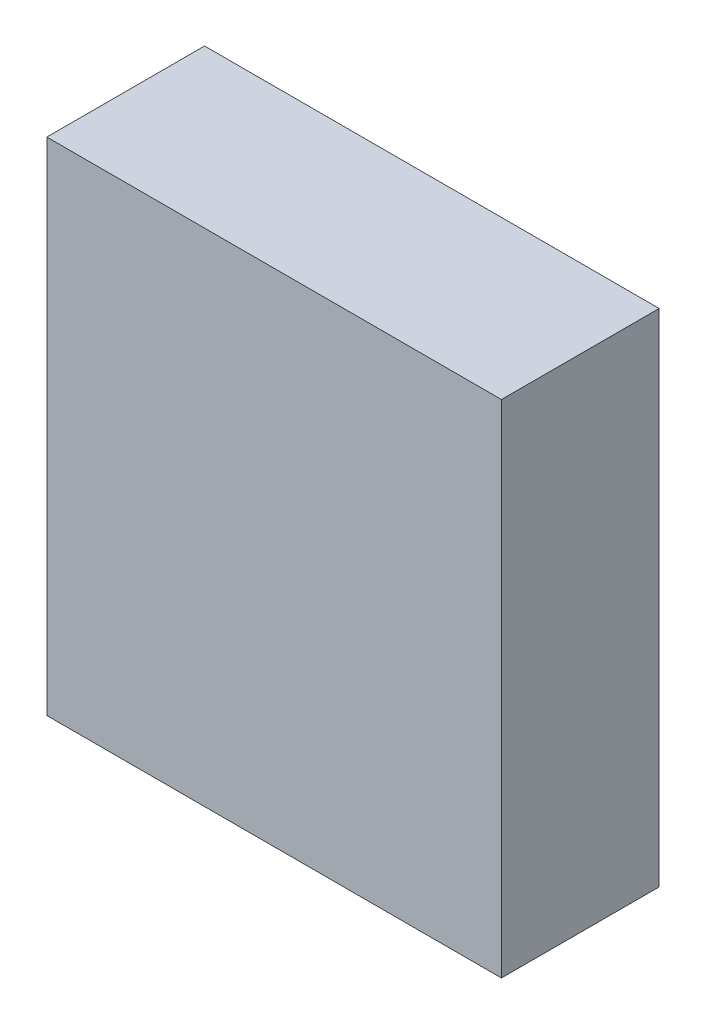
ISO-10303-21;
HEADER;
FILE_DESCRIPTION(('STEP AP214'),'2;1');
FILE_NAME('part.step','',(''),(''),'','','');
FILE_SCHEMA(('AUTOMOTIVE_DESIGN { 1 0 10303 214 1 1 1 1 }'));
ENDSEC;
DATA;
#1=APPLICATION_CONTEXT('core data for automotive mechanical design processes');
#2=APPLICATION_PROTOCOL_DEFINITION('international standard','automotive_design',2000,#1);
#3=PRODUCT_CONTEXT('',#1,'mechanical');
#4=PRODUCT('Part','Part','',(#3));
#5=PRODUCT_RELATED_PRODUCT_CATEGORY('part','',(#4));
#6=PRODUCT_DEFINITION_FORMATION('','',#4);
#7=PRODUCT_DEFINITION_CONTEXT('part definition',#1,'design');
#8=PRODUCT_DEFINITION('design','',#6,#7);
#9=PRODUCT_DEFINITION_SHAPE('','',#8);
#10=(LENGTH_UNIT() NAMED_UNIT(*) SI_UNIT(.MILLI.,.METRE.));
#11=(NAMED_UNIT(*) PLANE_ANGLE_UNIT() SI_UNIT($,.RADIAN.));
#12=(NAMED_UNIT(*) SI_UNIT($,.STERADIAN.) SOLID_ANGLE_UNIT());
#13=UNCERTAINTY_MEASURE_WITH_UNIT(LENGTH_MEASURE(1.E-05),#10,'distance_accuracy_value','');
#14=(GEOMETRIC_REPRESENTATION_CONTEXT(3) GLOBAL_UNCERTAINTY_ASSIGNED_CONTEXT((#13)) GLOBAL_UNIT_ASSIGNED_CONTEXT((#10,
#11,#12)) REPRESENTATION_CONTEXT('',''));
#15=CARTESIAN_POINT('',(0.,0.,0.));
#16=DIRECTION('',(0.,0.,1.));
#17=DIRECTION('',(1.,0.,0.));
#18=AXIS2_PLACEMENT_3D('',#15,#16,#17);
#19=CARTESIAN_POINT('',(-2.45000061648963,2.69998250302808,0.));
#20=DIRECTION('',(-1.,1.19248806385031E-08,0.));
#21=DIRECTION('',(-1.19248806385031E-08,-1.,0.));
#22=AXIS2_PLACEMENT_3D('',#19,#20,#21);
#23=PLANE('',#22);
#24=DIRECTION('',(-1.19248806627069E-08,-1.,0.));
#25=VECTOR('',#24,1.);
#26=CARTESIAN_POINT('',(-2.45000061648963,2.69998250302808,0.));
#27=LINE('',#26,#25);
#28=CARTESIAN_POINT('',(-2.45000061648963,2.69998250302808,0.));
#29=VERTEX_POINT('',#28);
#30=CARTESIAN_POINT('',(-2.45000068088392,-2.70001139345629,0.));
#31=VERTEX_POINT('',#30);
#32=EDGE_CURVE('E11',#29,#31,#27,.T.);
#33=ORIENTED_EDGE('',*,*,#32,.T.);
#34=DIRECTION('',(0.,0.,1.));
#35=VECTOR('',#34,1.);
#36=CARTESIAN_POINT('',(-2.45000068088391,-2.70001139345629,0.));
#37=LINE('',#36,#35);
#38=CARTESIAN_POINT('',(-2.45000068088392,-2.70001139345629,1.6999990940094));
#39=VERTEX_POINT('',#38);
#40=EDGE_CURVE('E88',#31,#39,#37,.T.);
#41=ORIENTED_EDGE('',*,*,#40,.T.);
#42=DIRECTION('',(-1.19248806627069E-08,-1.,0.));
#43=VECTOR('',#42,1.);
#44=CARTESIAN_POINT('',(-2.45000061648963,2.69998250302808,1.6999990940094));
#45=LINE('',#44,#43);
#46=CARTESIAN_POINT('',(-2.45000061648963,2.69998250302808,1.6999990940094));
#47=VERTEX_POINT('',#46);
#48=EDGE_CURVE('E83',#47,#39,#45,.T.);
#49=ORIENTED_EDGE('',*,*,#48,.F.);
#50=DIRECTION('',(0.,0.,1.));
#51=VECTOR('',#50,1.);
#52=CARTESIAN_POINT('',(-2.45000061648964,2.69998250302806,0.));
#53=LINE('',#52,#51);
#54=EDGE_CURVE('E72',#29,#47,#53,.T.);
#55=ORIENTED_EDGE('',*,*,#54,.F.);
#56=EDGE_LOOP('',(#33,#41,#49,#55));
#57=FACE_BOUND('',#56,.T.);
#58=ADVANCED_FACE('F17',(#57),#23,.T.);
#59=CARTESIAN_POINT('',(-2.45000068088392,-2.70001139345629,0.));
#60=DIRECTION('',(-1.19248806385031E-08,-1.,0.));
#61=DIRECTION('',(1.,-1.19248806385031E-08,0.));
#62=AXIS2_PLACEMENT_3D('',#59,#60,#61);
#63=PLANE('',#62);
#64=DIRECTION('',(1.,-1.1924880625848E-08,0.));
#65=VECTOR('',#64,1.);
#66=CARTESIAN_POINT('',(-2.45000068088392,-2.70001139345629,0.));
#67=LINE('',#66,#65);
#68=CARTESIAN_POINT('',(2.44999703029772,-2.7000114518882,0.));
#69=VERTEX_POINT('',#68);
#70=EDGE_CURVE('E24',#31,#69,#67,.T.);
#71=ORIENTED_EDGE('',*,*,#70,.T.);
#72=DIRECTION('',(0.,0.,1.));
#73=VECTOR('',#72,1.);
#74=CARTESIAN_POINT('',(2.44999703029772,-2.70001145188818,0.));
#75=LINE('',#74,#73);
#76=CARTESIAN_POINT('',(2.44999703029772,-2.7000114518882,1.6999990940094));
#77=VERTEX_POINT('',#76);
#78=EDGE_CURVE('E85',#69,#77,#75,.T.);
#79=ORIENTED_EDGE('',*,*,#78,.T.);
#80=DIRECTION('',(1.,-1.1924880625848E-08,0.));
#81=VECTOR('',#80,1.);
#82=CARTESIAN_POINT('',(-2.45000068088392,-2.70001139345629,1.6999990940094));
#83=LINE('',#82,#81);
#84=EDGE_CURVE('E66',#39,#77,#83,.T.);
#85=ORIENTED_EDGE('',*,*,#84,.F.);
#86=ORIENTED_EDGE('',*,*,#40,.F.);
#87=EDGE_LOOP('',(#71,#79,#85,#86));
#88=FACE_BOUND('',#87,.T.);
#89=ADVANCED_FACE('F89',(#88),#63,.T.);
#90=CARTESIAN_POINT('',(2.44999703029772,-2.7000114518882,0.));
#91=DIRECTION('',(1.,-1.19248806385031E-08,0.));
#92=DIRECTION('',(1.19248806385031E-08,1.,0.));
#93=AXIS2_PLACEMENT_3D('',#90,#91,#92);
#94=PLANE('',#93);
#95=DIRECTION('',(1.19248806627069E-08,1.,0.));
#96=VECTOR('',#95,1.);
#97=CARTESIAN_POINT('',(2.44999703029772,-2.7000114518882,0.));
#98=LINE('',#97,#96);
#99=CARTESIAN_POINT('',(2.449997094692,2.69998244459617,0.));
#100=VERTEX_POINT('',#99);
#101=EDGE_CURVE('E62',#69,#100,#98,.T.);
#102=ORIENTED_EDGE('',*,*,#101,.T.);
#103=DIRECTION('',(0.,0.,1.));
#104=VECTOR('',#103,1.);
#105=CARTESIAN_POINT('',(2.44999709469201,2.69998244459617,0.));
#106=LINE('',#105,#104);
#107=CARTESIAN_POINT('',(2.449997094692,2.69998244459617,1.6999990940094));
#108=VERTEX_POINT('',#107);
#109=EDGE_CURVE('E55',#100,#108,#106,.T.);
#110=ORIENTED_EDGE('',*,*,#109,.T.);
#111=DIRECTION('',(1.19248806627069E-08,1.,0.));
#112=VECTOR('',#111,1.);
#113=CARTESIAN_POINT('',(2.44999703029772,-2.7000114518882,1.6999990940094));
#114=LINE('',#113,#112);
#115=EDGE_CURVE('E59',#77,#108,#114,.T.);
#116=ORIENTED_EDGE('',*,*,#115,.F.);
#117=ORIENTED_EDGE('',*,*,#78,.F.);
#118=EDGE_LOOP('',(#102,#110,#116,#117));
#119=FACE_BOUND('',#118,.T.);
#120=ADVANCED_FACE('F57',(#119),#94,.T.);
#121=CARTESIAN_POINT('',(2.449997094692,2.69998244459617,0.));
#122=DIRECTION('',(1.19248806385031E-08,1.,0.));
#123=DIRECTION('',(-1.,1.19248806385031E-08,0.));
#124=AXIS2_PLACEMENT_3D('',#121,#122,#123);
#125=PLANE('',#124);
#126=DIRECTION('',(-1.,1.1924880625848E-08,0.));
#127=VECTOR('',#126,1.);
#128=CARTESIAN_POINT('',(2.449997094692,2.69998244459617,0.));
#129=LINE('',#128,#127);
#130=EDGE_CURVE('E65',#100,#29,#129,.T.);
#131=ORIENTED_EDGE('',*,*,#130,.T.);
#132=ORIENTED_EDGE('',*,*,#54,.T.);
#133=DIRECTION('',(-1.,1.1924880625848E-08,0.));
#134=VECTOR('',#133,1.);
#135=CARTESIAN_POINT('',(2.449997094692,2.69998244459617,1.6999990940094));
#136=LINE('',#135,#134);
#137=EDGE_CURVE('E70',#108,#47,#136,.T.);
#138=ORIENTED_EDGE('',*,*,#137,.F.);
#139=ORIENTED_EDGE('',*,*,#109,.F.);
#140=EDGE_LOOP('',(#131,#132,#138,#139));
#141=FACE_BOUND('',#140,.T.);
#142=ADVANCED_FACE('F71',(#141),#125,.T.);
#143=CARTESIAN_POINT('',(65.7749938964844,-329.475006103516,1.6999990940094));
#144=DIRECTION('',(0.,0.,1.));
#145=DIRECTION('',(1.19248806385031E-08,1.,0.));
#146=AXIS2_PLACEMENT_3D('',#143,#144,#145);
#147=PLANE('',#146);
#148=ORIENTED_EDGE('',*,*,#48,.T.);
#149=ORIENTED_EDGE('',*,*,#84,.T.);
#150=ORIENTED_EDGE('',*,*,#115,.T.);
#151=ORIENTED_EDGE('',*,*,#137,.T.);
#152=EDGE_LOOP('',(#148,#149,#150,#151));
#153=FACE_BOUND('',#152,.T.);
#154=ADVANCED_FACE('F76',(#153),#147,.T.);
#155=CARTESIAN_POINT('',(65.7749938964844,-329.475006103516,0.));
#156=DIRECTION('',(0.,0.,1.));
#157=DIRECTION('',(1.19248806385031E-08,1.,0.));
#158=AXIS2_PLACEMENT_3D('',#155,#156,#157);
#159=PLANE('',#158);
#160=ORIENTED_EDGE('',*,*,#130,.F.);
#161=ORIENTED_EDGE('',*,*,#101,.F.);
#162=ORIENTED_EDGE('',*,*,#70,.F.);
#163=ORIENTED_EDGE('',*,*,#32,.F.);
#164=EDGE_LOOP('',(#160,#161,#162,#163));
#165=FACE_BOUND('',#164,.T.);
#166=ADVANCED_FACE('F91',(#165),#159,.F.);
#167=CLOSED_SHELL('',(#58,#89,#120,#142,#154,#166));
#168=MANIFOLD_SOLID_BREP('B1',#167);
#169=ADVANCED_BREP_SHAPE_REPRESENTATION('',(#18,#168),#14);
#170=SHAPE_DEFINITION_REPRESENTATION(#9,#169);
ENDSEC;
END-ISO-10303-21;
